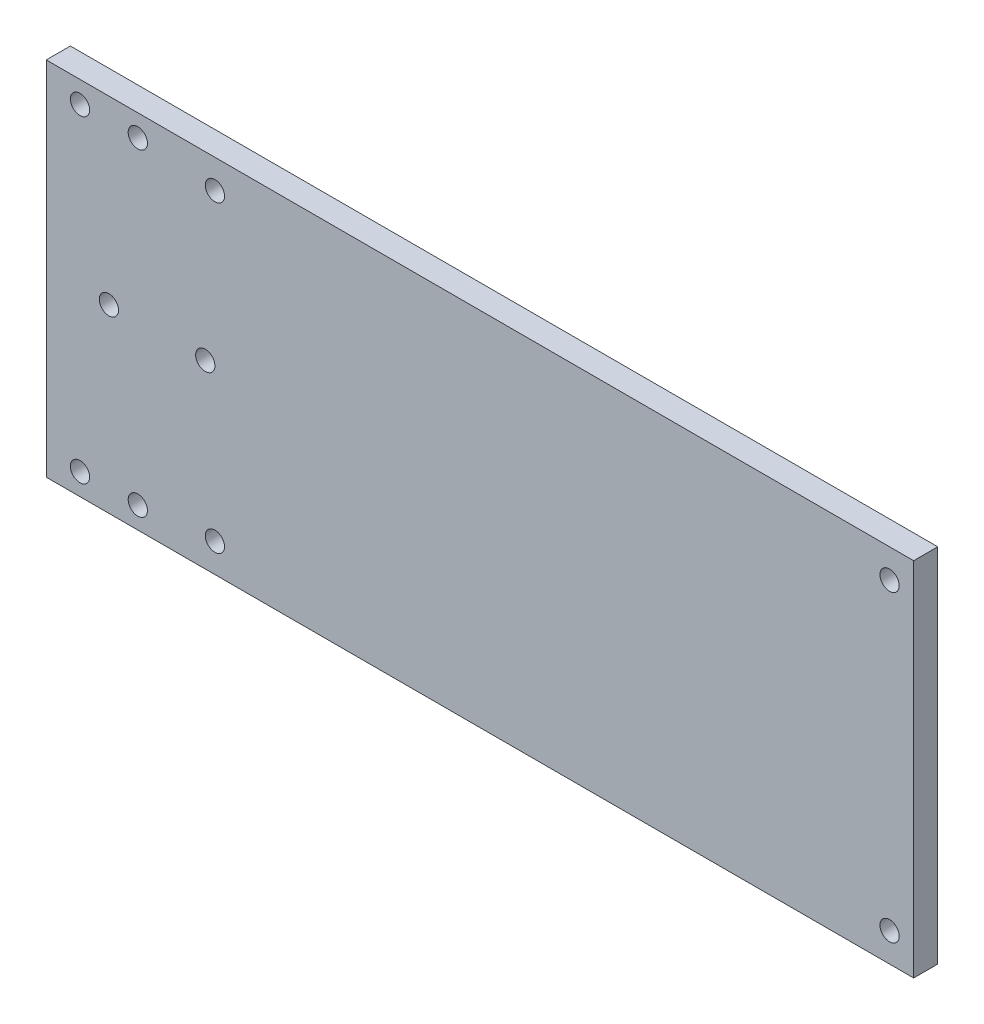
ISO-10303-21;
HEADER;
FILE_DESCRIPTION(('STEP AP214'),'2;1');
FILE_NAME('part.step','',(''),(''),'','','');
FILE_SCHEMA(('AUTOMOTIVE_DESIGN { 1 0 10303 214 1 1 1 1 }'));
ENDSEC;
DATA;
#1=APPLICATION_CONTEXT('core data for automotive mechanical design processes');
#2=APPLICATION_PROTOCOL_DEFINITION('international standard','automotive_design',2000,#1);
#3=PRODUCT_CONTEXT('',#1,'mechanical');
#4=PRODUCT('Part','Part','',(#3));
#5=PRODUCT_RELATED_PRODUCT_CATEGORY('part','',(#4));
#6=PRODUCT_DEFINITION_FORMATION('','',#4);
#7=PRODUCT_DEFINITION_CONTEXT('part definition',#1,'design');
#8=PRODUCT_DEFINITION('design','',#6,#7);
#9=PRODUCT_DEFINITION_SHAPE('','',#8);
#10=(LENGTH_UNIT() NAMED_UNIT(*) SI_UNIT(.MILLI.,.METRE.));
#11=(NAMED_UNIT(*) PLANE_ANGLE_UNIT() SI_UNIT($,.RADIAN.));
#12=(NAMED_UNIT(*) SI_UNIT($,.STERADIAN.) SOLID_ANGLE_UNIT());
#13=UNCERTAINTY_MEASURE_WITH_UNIT(LENGTH_MEASURE(1.E-05),#10,'distance_accuracy_value','');
#14=(GEOMETRIC_REPRESENTATION_CONTEXT(3) GLOBAL_UNCERTAINTY_ASSIGNED_CONTEXT((#13)) GLOBAL_UNIT_ASSIGNED_CONTEXT((#10,
#11,#12)) REPRESENTATION_CONTEXT('',''));
#15=CARTESIAN_POINT('',(0.,0.,0.));
#16=DIRECTION('',(0.,0.,1.));
#17=DIRECTION('',(1.,0.,0.));
#18=AXIS2_PLACEMENT_3D('',#15,#16,#17);
#19=CARTESIAN_POINT('',(0.,0.,5.));
#20=DIRECTION('',(0.,0.,-1.));
#21=DIRECTION('',(-1.,0.,0.));
#22=AXIS2_PLACEMENT_3D('',#19,#20,#21);
#23=PLANE('',#22);
#24=DIRECTION('',(0.,1.,0.));
#25=VECTOR('',#24,1.);
#26=CARTESIAN_POINT('',(90.,-37.5,5.));
#27=LINE('',#26,#25);
#28=CARTESIAN_POINT('',(90.,-37.5,5.));
#29=VERTEX_POINT('',#28);
#30=CARTESIAN_POINT('',(90.,37.5,5.));
#31=VERTEX_POINT('',#30);
#32=EDGE_CURVE('E85',#29,#31,#27,.T.);
#33=ORIENTED_EDGE('',*,*,#32,.T.);
#34=DIRECTION('',(-1.,0.,0.));
#35=VECTOR('',#34,1.);
#36=CARTESIAN_POINT('',(-90.,37.5,5.));
#37=LINE('',#36,#35);
#38=CARTESIAN_POINT('',(-90.,37.5,5.));
#39=VERTEX_POINT('',#38);
#40=EDGE_CURVE('E80',#31,#39,#37,.T.);
#41=ORIENTED_EDGE('',*,*,#40,.T.);
#42=DIRECTION('',(0.,-1.,0.));
#43=VECTOR('',#42,1.);
#44=CARTESIAN_POINT('',(-90.,-37.5,5.));
#45=LINE('',#44,#43);
#46=CARTESIAN_POINT('',(-90.,-37.5,5.));
#47=VERTEX_POINT('',#46);
#48=EDGE_CURVE('E83',#39,#47,#45,.T.);
#49=ORIENTED_EDGE('',*,*,#48,.T.);
#50=DIRECTION('',(1.,0.,0.));
#51=VECTOR('',#50,1.);
#52=CARTESIAN_POINT('',(-90.,-37.5,5.));
#53=LINE('',#52,#51);
#54=EDGE_CURVE('E50',#47,#29,#53,.T.);
#55=ORIENTED_EDGE('',*,*,#54,.T.);
#56=EDGE_LOOP('',(#33,#41,#49,#55));
#57=FACE_BOUND('',#56,.T.);
#58=CARTESIAN_POINT('',(-83.,33.,5.));
#59=DIRECTION('',(0.,0.,1.));
#60=DIRECTION('',(1.,0.,0.));
#61=AXIS2_PLACEMENT_3D('',#58,#59,#60);
#62=CIRCLE('',#61,2.);
#63=CARTESIAN_POINT('',(-81.,33.,5.));
#64=VERTEX_POINT('',#63);
#65=EDGE_CURVE('E100',#64,#64,#62,.T.);
#66=ORIENTED_EDGE('',*,*,#65,.F.);
#67=EDGE_LOOP('',(#66));
#68=FACE_BOUND('',#67,.T.);
#69=CARTESIAN_POINT('',(-76.9999999999976,0.,5.));
#70=DIRECTION('',(0.,0.,1.));
#71=DIRECTION('',(1.,0.,0.));
#72=AXIS2_PLACEMENT_3D('',#69,#70,#71);
#73=CIRCLE('',#72,2.);
#74=CARTESIAN_POINT('',(-74.9999999999976,0.,5.));
#75=VERTEX_POINT('',#74);
#76=EDGE_CURVE('E115',#75,#75,#73,.T.);
#77=ORIENTED_EDGE('',*,*,#76,.F.);
#78=EDGE_LOOP('',(#77));
#79=FACE_BOUND('',#78,.T.);
#80=CARTESIAN_POINT('',(-71.,33.,5.));
#81=DIRECTION('',(0.,0.,1.));
#82=DIRECTION('',(1.,0.,0.));
#83=AXIS2_PLACEMENT_3D('',#80,#81,#82);
#84=CIRCLE('',#83,2.);
#85=CARTESIAN_POINT('',(-69.,33.,5.));
#86=VERTEX_POINT('',#85);
#87=EDGE_CURVE('E121',#86,#86,#84,.T.);
#88=ORIENTED_EDGE('',*,*,#87,.F.);
#89=EDGE_LOOP('',(#88));
#90=FACE_BOUND('',#89,.T.);
#91=CARTESIAN_POINT('',(-70.9999999999956,-33.,5.));
#92=DIRECTION('',(0.,0.,1.));
#93=DIRECTION('',(1.,0.,0.));
#94=AXIS2_PLACEMENT_3D('',#91,#92,#93);
#95=CIRCLE('',#94,2.);
#96=CARTESIAN_POINT('',(-68.9999999999956,-33.,5.));
#97=VERTEX_POINT('',#96);
#98=EDGE_CURVE('E127',#97,#97,#95,.T.);
#99=ORIENTED_EDGE('',*,*,#98,.F.);
#100=EDGE_LOOP('',(#99));
#101=FACE_BOUND('',#100,.T.);
#102=CARTESIAN_POINT('',(-56.9999999999976,0.,5.));
#103=DIRECTION('',(0.,0.,1.));
#104=DIRECTION('',(1.,0.,0.));
#105=AXIS2_PLACEMENT_3D('',#102,#103,#104);
#106=CIRCLE('',#105,2.);
#107=CARTESIAN_POINT('',(-54.9999999999976,0.,5.));
#108=VERTEX_POINT('',#107);
#109=EDGE_CURVE('E133',#108,#108,#106,.T.);
#110=ORIENTED_EDGE('',*,*,#109,.F.);
#111=EDGE_LOOP('',(#110));
#112=FACE_BOUND('',#111,.T.);
#113=CARTESIAN_POINT('',(-82.9999999999965,-33.,5.));
#114=DIRECTION('',(0.,0.,1.));
#115=DIRECTION('',(1.,0.,0.));
#116=AXIS2_PLACEMENT_3D('',#113,#114,#115);
#117=CIRCLE('',#116,2.);
#118=CARTESIAN_POINT('',(-80.9999999999965,-33.,5.));
#119=VERTEX_POINT('',#118);
#120=EDGE_CURVE('E139',#119,#119,#117,.T.);
#121=ORIENTED_EDGE('',*,*,#120,.F.);
#122=EDGE_LOOP('',(#121));
#123=FACE_BOUND('',#122,.T.);
#124=CARTESIAN_POINT('',(-55.,31.5,5.));
#125=DIRECTION('',(0.,0.,1.));
#126=DIRECTION('',(1.,0.,0.));
#127=AXIS2_PLACEMENT_3D('',#124,#125,#126);
#128=CIRCLE('',#127,2.);
#129=CARTESIAN_POINT('',(-53.,31.5,5.));
#130=VERTEX_POINT('',#129);
#131=EDGE_CURVE('E145',#130,#130,#128,.T.);
#132=ORIENTED_EDGE('',*,*,#131,.F.);
#133=EDGE_LOOP('',(#132));
#134=FACE_BOUND('',#133,.T.);
#135=CARTESIAN_POINT('',(85.,31.5,5.));
#136=DIRECTION('',(0.,0.,1.));
#137=DIRECTION('',(1.,0.,0.));
#138=AXIS2_PLACEMENT_3D('',#135,#136,#137);
#139=CIRCLE('',#138,2.);
#140=CARTESIAN_POINT('',(87.,31.5,5.));
#141=VERTEX_POINT('',#140);
#142=EDGE_CURVE('E151',#141,#141,#139,.T.);
#143=ORIENTED_EDGE('',*,*,#142,.F.);
#144=EDGE_LOOP('',(#143));
#145=FACE_BOUND('',#144,.T.);
#146=CARTESIAN_POINT('',(85.,-31.5,5.));
#147=DIRECTION('',(0.,0.,1.));
#148=DIRECTION('',(-1.,0.,0.));
#149=AXIS2_PLACEMENT_3D('',#146,#147,#148);
#150=CIRCLE('',#149,2.);
#151=CARTESIAN_POINT('',(83.,-31.5,5.));
#152=VERTEX_POINT('',#151);
#153=EDGE_CURVE('E157',#152,#152,#150,.T.);
#154=ORIENTED_EDGE('',*,*,#153,.F.);
#155=EDGE_LOOP('',(#154));
#156=FACE_BOUND('',#155,.T.);
#157=CARTESIAN_POINT('',(-55.,-31.5,5.));
#158=DIRECTION('',(0.,0.,1.));
#159=DIRECTION('',(-1.,0.,0.));
#160=AXIS2_PLACEMENT_3D('',#157,#158,#159);
#161=CIRCLE('',#160,2.);
#162=CARTESIAN_POINT('',(-57.,-31.5,5.));
#163=VERTEX_POINT('',#162);
#164=EDGE_CURVE('E163',#163,#163,#161,.T.);
#165=ORIENTED_EDGE('',*,*,#164,.F.);
#166=EDGE_LOOP('',(#165));
#167=FACE_BOUND('',#166,.T.);
#168=ADVANCED_FACE('F33',(#57,#68,#79,#90,#101,#112,#123,#134,#145,#156,#167),#23,.F.);
#169=CARTESIAN_POINT('',(0.,0.,0.));
#170=DIRECTION('',(0.,0.,-1.));
#171=DIRECTION('',(-1.,0.,0.));
#172=AXIS2_PLACEMENT_3D('',#169,#170,#171);
#173=PLANE('',#172);
#174=CARTESIAN_POINT('',(85.,-31.5,0.));
#175=DIRECTION('',(0.,0.,1.));
#176=DIRECTION('',(-1.,0.,0.));
#177=AXIS2_PLACEMENT_3D('',#174,#175,#176);
#178=CIRCLE('',#177,2.);
#179=CARTESIAN_POINT('',(83.,-31.5,0.));
#180=VERTEX_POINT('',#179);
#181=EDGE_CURVE('E160',#180,#180,#178,.T.);
#182=ORIENTED_EDGE('',*,*,#181,.T.);
#183=EDGE_LOOP('',(#182));
#184=FACE_BOUND('',#183,.T.);
#185=CARTESIAN_POINT('',(-55.,31.5,0.));
#186=DIRECTION('',(0.,0.,1.));
#187=DIRECTION('',(1.,0.,0.));
#188=AXIS2_PLACEMENT_3D('',#185,#186,#187);
#189=CIRCLE('',#188,2.);
#190=CARTESIAN_POINT('',(-53.,31.5,0.));
#191=VERTEX_POINT('',#190);
#192=EDGE_CURVE('E148',#191,#191,#189,.T.);
#193=ORIENTED_EDGE('',*,*,#192,.T.);
#194=EDGE_LOOP('',(#193));
#195=FACE_BOUND('',#194,.T.);
#196=CARTESIAN_POINT('',(-56.9999999999976,0.,0.));
#197=DIRECTION('',(0.,0.,1.));
#198=DIRECTION('',(1.,0.,0.));
#199=AXIS2_PLACEMENT_3D('',#196,#197,#198);
#200=CIRCLE('',#199,2.);
#201=CARTESIAN_POINT('',(-54.9999999999976,0.,0.));
#202=VERTEX_POINT('',#201);
#203=EDGE_CURVE('E136',#202,#202,#200,.T.);
#204=ORIENTED_EDGE('',*,*,#203,.T.);
#205=EDGE_LOOP('',(#204));
#206=FACE_BOUND('',#205,.T.);
#207=CARTESIAN_POINT('',(-71.,33.,0.));
#208=DIRECTION('',(0.,0.,1.));
#209=DIRECTION('',(1.,0.,0.));
#210=AXIS2_PLACEMENT_3D('',#207,#208,#209);
#211=CIRCLE('',#210,2.);
#212=CARTESIAN_POINT('',(-69.,33.,0.));
#213=VERTEX_POINT('',#212);
#214=EDGE_CURVE('E124',#213,#213,#211,.T.);
#215=ORIENTED_EDGE('',*,*,#214,.T.);
#216=EDGE_LOOP('',(#215));
#217=FACE_BOUND('',#216,.T.);
#218=CARTESIAN_POINT('',(-83.,33.,0.));
#219=DIRECTION('',(0.,0.,1.));
#220=DIRECTION('',(1.,0.,0.));
#221=AXIS2_PLACEMENT_3D('',#218,#219,#220);
#222=CIRCLE('',#221,2.);
#223=CARTESIAN_POINT('',(-81.,33.,0.));
#224=VERTEX_POINT('',#223);
#225=EDGE_CURVE('E112',#224,#224,#222,.T.);
#226=ORIENTED_EDGE('',*,*,#225,.T.);
#227=EDGE_LOOP('',(#226));
#228=FACE_BOUND('',#227,.T.);
#229=DIRECTION('',(0.,1.,0.));
#230=VECTOR('',#229,1.);
#231=CARTESIAN_POINT('',(90.,-37.5,0.));
#232=LINE('',#231,#230);
#233=CARTESIAN_POINT('',(90.,-37.5,0.));
#234=VERTEX_POINT('',#233);
#235=CARTESIAN_POINT('',(90.,37.5,0.));
#236=VERTEX_POINT('',#235);
#237=EDGE_CURVE('E97',#234,#236,#232,.T.);
#238=ORIENTED_EDGE('',*,*,#237,.F.);
#239=DIRECTION('',(1.,0.,0.));
#240=VECTOR('',#239,1.);
#241=CARTESIAN_POINT('',(-90.,-37.5,0.));
#242=LINE('',#241,#240);
#243=CARTESIAN_POINT('',(-90.,-37.5,0.));
#244=VERTEX_POINT('',#243);
#245=EDGE_CURVE('E73',#244,#234,#242,.T.);
#246=ORIENTED_EDGE('',*,*,#245,.F.);
#247=DIRECTION('',(0.,-1.,0.));
#248=VECTOR('',#247,1.);
#249=CARTESIAN_POINT('',(-90.,-37.5,0.));
#250=LINE('',#249,#248);
#251=CARTESIAN_POINT('',(-90.,37.5,0.));
#252=VERTEX_POINT('',#251);
#253=EDGE_CURVE('E67',#252,#244,#250,.T.);
#254=ORIENTED_EDGE('',*,*,#253,.F.);
#255=DIRECTION('',(-1.,0.,0.));
#256=VECTOR('',#255,1.);
#257=CARTESIAN_POINT('',(-90.,37.5,0.));
#258=LINE('',#257,#256);
#259=EDGE_CURVE('E89',#236,#252,#258,.T.);
#260=ORIENTED_EDGE('',*,*,#259,.F.);
#261=EDGE_LOOP('',(#238,#246,#254,#260));
#262=FACE_BOUND('',#261,.T.);
#263=CARTESIAN_POINT('',(-76.9999999999976,0.,0.));
#264=DIRECTION('',(0.,0.,1.));
#265=DIRECTION('',(1.,0.,0.));
#266=AXIS2_PLACEMENT_3D('',#263,#264,#265);
#267=CIRCLE('',#266,2.);
#268=CARTESIAN_POINT('',(-74.9999999999976,0.,0.));
#269=VERTEX_POINT('',#268);
#270=EDGE_CURVE('E118',#269,#269,#267,.T.);
#271=ORIENTED_EDGE('',*,*,#270,.T.);
#272=EDGE_LOOP('',(#271));
#273=FACE_BOUND('',#272,.T.);
#274=CARTESIAN_POINT('',(-70.9999999999956,-33.,0.));
#275=DIRECTION('',(0.,0.,1.));
#276=DIRECTION('',(1.,0.,0.));
#277=AXIS2_PLACEMENT_3D('',#274,#275,#276);
#278=CIRCLE('',#277,2.);
#279=CARTESIAN_POINT('',(-68.9999999999956,-33.,0.));
#280=VERTEX_POINT('',#279);
#281=EDGE_CURVE('E130',#280,#280,#278,.T.);
#282=ORIENTED_EDGE('',*,*,#281,.T.);
#283=EDGE_LOOP('',(#282));
#284=FACE_BOUND('',#283,.T.);
#285=CARTESIAN_POINT('',(-82.9999999999965,-33.,0.));
#286=DIRECTION('',(0.,0.,1.));
#287=DIRECTION('',(1.,0.,0.));
#288=AXIS2_PLACEMENT_3D('',#285,#286,#287);
#289=CIRCLE('',#288,2.);
#290=CARTESIAN_POINT('',(-80.9999999999965,-33.,0.));
#291=VERTEX_POINT('',#290);
#292=EDGE_CURVE('E142',#291,#291,#289,.T.);
#293=ORIENTED_EDGE('',*,*,#292,.T.);
#294=EDGE_LOOP('',(#293));
#295=FACE_BOUND('',#294,.T.);
#296=CARTESIAN_POINT('',(85.,31.5,0.));
#297=DIRECTION('',(0.,0.,1.));
#298=DIRECTION('',(1.,0.,0.));
#299=AXIS2_PLACEMENT_3D('',#296,#297,#298);
#300=CIRCLE('',#299,2.);
#301=CARTESIAN_POINT('',(87.,31.5,0.));
#302=VERTEX_POINT('',#301);
#303=EDGE_CURVE('E154',#302,#302,#300,.T.);
#304=ORIENTED_EDGE('',*,*,#303,.T.);
#305=EDGE_LOOP('',(#304));
#306=FACE_BOUND('',#305,.T.);
#307=CARTESIAN_POINT('',(-55.,-31.5,0.));
#308=DIRECTION('',(0.,0.,1.));
#309=DIRECTION('',(-1.,0.,0.));
#310=AXIS2_PLACEMENT_3D('',#307,#308,#309);
#311=CIRCLE('',#310,2.);
#312=CARTESIAN_POINT('',(-57.,-31.5,0.));
#313=VERTEX_POINT('',#312);
#314=EDGE_CURVE('E166',#313,#313,#311,.T.);
#315=ORIENTED_EDGE('',*,*,#314,.T.);
#316=EDGE_LOOP('',(#315));
#317=FACE_BOUND('',#316,.T.);
#318=ADVANCED_FACE('F108',(#184,#195,#206,#217,#228,#262,#273,#284,#295,#306,#317),#173,.T.);
#319=CARTESIAN_POINT('',(90.,-37.5,5.));
#320=DIRECTION('',(-1.,0.,0.));
#321=DIRECTION('',(0.,0.,1.));
#322=AXIS2_PLACEMENT_3D('',#319,#320,#321);
#323=PLANE('',#322);
#324=ORIENTED_EDGE('',*,*,#237,.T.);
#325=DIRECTION('',(0.,0.,-1.));
#326=VECTOR('',#325,1.);
#327=CARTESIAN_POINT('',(90.,37.5,5.));
#328=LINE('',#327,#326);
#329=EDGE_CURVE('E11',#31,#236,#328,.T.);
#330=ORIENTED_EDGE('',*,*,#329,.F.);
#331=ORIENTED_EDGE('',*,*,#32,.F.);
#332=DIRECTION('',(0.,0.,-1.));
#333=VECTOR('',#332,1.);
#334=CARTESIAN_POINT('',(90.,-37.5,5.));
#335=LINE('',#334,#333);
#336=EDGE_CURVE('E93',#29,#234,#335,.T.);
#337=ORIENTED_EDGE('',*,*,#336,.T.);
#338=EDGE_LOOP('',(#324,#330,#331,#337));
#339=FACE_BOUND('',#338,.T.);
#340=ADVANCED_FACE('F35',(#339),#323,.F.);
#341=CARTESIAN_POINT('',(-90.,37.5,5.));
#342=DIRECTION('',(0.,-1.,0.));
#343=DIRECTION('',(0.,0.,-1.));
#344=AXIS2_PLACEMENT_3D('',#341,#342,#343);
#345=PLANE('',#344);
#346=ORIENTED_EDGE('',*,*,#259,.T.);
#347=DIRECTION('',(0.,0.,-1.));
#348=VECTOR('',#347,1.);
#349=CARTESIAN_POINT('',(-90.,37.5,5.));
#350=LINE('',#349,#348);
#351=EDGE_CURVE('E42',#39,#252,#350,.T.);
#352=ORIENTED_EDGE('',*,*,#351,.F.);
#353=ORIENTED_EDGE('',*,*,#40,.F.);
#354=ORIENTED_EDGE('',*,*,#329,.T.);
#355=EDGE_LOOP('',(#346,#352,#353,#354));
#356=FACE_BOUND('',#355,.T.);
#357=ADVANCED_FACE('F88',(#356),#345,.F.);
#358=CARTESIAN_POINT('',(-90.,-37.5,5.));
#359=DIRECTION('',(1.,0.,0.));
#360=DIRECTION('',(0.,0.,-1.));
#361=AXIS2_PLACEMENT_3D('',#358,#359,#360);
#362=PLANE('',#361);
#363=ORIENTED_EDGE('',*,*,#253,.T.);
#364=DIRECTION('',(0.,0.,-1.));
#365=VECTOR('',#364,1.);
#366=CARTESIAN_POINT('',(-90.,-37.5,5.));
#367=LINE('',#366,#365);
#368=EDGE_CURVE('E90',#47,#244,#367,.T.);
#369=ORIENTED_EDGE('',*,*,#368,.F.);
#370=ORIENTED_EDGE('',*,*,#48,.F.);
#371=ORIENTED_EDGE('',*,*,#351,.T.);
#372=EDGE_LOOP('',(#363,#369,#370,#371));
#373=FACE_BOUND('',#372,.T.);
#374=ADVANCED_FACE('F91',(#373),#362,.F.);
#375=CARTESIAN_POINT('',(-90.,-37.5,5.));
#376=DIRECTION('',(0.,1.,0.));
#377=DIRECTION('',(0.,0.,1.));
#378=AXIS2_PLACEMENT_3D('',#375,#376,#377);
#379=PLANE('',#378);
#380=ORIENTED_EDGE('',*,*,#245,.T.);
#381=ORIENTED_EDGE('',*,*,#336,.F.);
#382=ORIENTED_EDGE('',*,*,#54,.F.);
#383=ORIENTED_EDGE('',*,*,#368,.T.);
#384=EDGE_LOOP('',(#380,#381,#382,#383));
#385=FACE_BOUND('',#384,.T.);
#386=ADVANCED_FACE('F105',(#385),#379,.F.);
#387=CARTESIAN_POINT('',(-83.,33.,5.));
#388=DIRECTION('',(0.,0.,-1.));
#389=DIRECTION('',(-1.,0.,0.));
#390=AXIS2_PLACEMENT_3D('',#387,#388,#389);
#391=CYLINDRICAL_SURFACE('',#390,2.);
#392=ORIENTED_EDGE('',*,*,#65,.T.);
#393=EDGE_LOOP('',(#392));
#394=FACE_BOUND('',#393,.T.);
#395=ORIENTED_EDGE('',*,*,#225,.F.);
#396=EDGE_LOOP('',(#395));
#397=FACE_BOUND('',#396,.T.);
#398=ADVANCED_FACE('F183',(#394,#397),#391,.F.);
#399=CARTESIAN_POINT('',(-76.9999999999976,0.,5.));
#400=DIRECTION('',(0.,0.,-1.));
#401=DIRECTION('',(-1.,0.,0.));
#402=AXIS2_PLACEMENT_3D('',#399,#400,#401);
#403=CYLINDRICAL_SURFACE('',#402,2.);
#404=ORIENTED_EDGE('',*,*,#76,.T.);
#405=EDGE_LOOP('',(#404));
#406=FACE_BOUND('',#405,.T.);
#407=ORIENTED_EDGE('',*,*,#270,.F.);
#408=EDGE_LOOP('',(#407));
#409=FACE_BOUND('',#408,.T.);
#410=ADVANCED_FACE('F229',(#406,#409),#403,.F.);
#411=CARTESIAN_POINT('',(-71.,33.,5.));
#412=DIRECTION('',(0.,0.,-1.));
#413=DIRECTION('',(-1.,0.,0.));
#414=AXIS2_PLACEMENT_3D('',#411,#412,#413);
#415=CYLINDRICAL_SURFACE('',#414,2.);
#416=ORIENTED_EDGE('',*,*,#87,.T.);
#417=EDGE_LOOP('',(#416));
#418=FACE_BOUND('',#417,.T.);
#419=ORIENTED_EDGE('',*,*,#214,.F.);
#420=EDGE_LOOP('',(#419));
#421=FACE_BOUND('',#420,.T.);
#422=ADVANCED_FACE('F237',(#418,#421),#415,.F.);
#423=CARTESIAN_POINT('',(-70.9999999999956,-33.,5.));
#424=DIRECTION('',(0.,0.,-1.));
#425=DIRECTION('',(-1.,0.,0.));
#426=AXIS2_PLACEMENT_3D('',#423,#424,#425);
#427=CYLINDRICAL_SURFACE('',#426,2.);
#428=ORIENTED_EDGE('',*,*,#98,.T.);
#429=EDGE_LOOP('',(#428));
#430=FACE_BOUND('',#429,.T.);
#431=ORIENTED_EDGE('',*,*,#281,.F.);
#432=EDGE_LOOP('',(#431));
#433=FACE_BOUND('',#432,.T.);
#434=ADVANCED_FACE('F245',(#430,#433),#427,.F.);
#435=CARTESIAN_POINT('',(-56.9999999999976,0.,5.));
#436=DIRECTION('',(0.,0.,-1.));
#437=DIRECTION('',(-1.,0.,0.));
#438=AXIS2_PLACEMENT_3D('',#435,#436,#437);
#439=CYLINDRICAL_SURFACE('',#438,2.);
#440=ORIENTED_EDGE('',*,*,#109,.T.);
#441=EDGE_LOOP('',(#440));
#442=FACE_BOUND('',#441,.T.);
#443=ORIENTED_EDGE('',*,*,#203,.F.);
#444=EDGE_LOOP('',(#443));
#445=FACE_BOUND('',#444,.T.);
#446=ADVANCED_FACE('F254',(#442,#445),#439,.F.);
#447=CARTESIAN_POINT('',(-82.9999999999965,-33.,5.));
#448=DIRECTION('',(0.,0.,-1.));
#449=DIRECTION('',(-1.,0.,0.));
#450=AXIS2_PLACEMENT_3D('',#447,#448,#449);
#451=CYLINDRICAL_SURFACE('',#450,2.);
#452=ORIENTED_EDGE('',*,*,#120,.T.);
#453=EDGE_LOOP('',(#452));
#454=FACE_BOUND('',#453,.T.);
#455=ORIENTED_EDGE('',*,*,#292,.F.);
#456=EDGE_LOOP('',(#455));
#457=FACE_BOUND('',#456,.T.);
#458=ADVANCED_FACE('F263',(#454,#457),#451,.F.);
#459=CARTESIAN_POINT('',(-55.,31.5,5.));
#460=DIRECTION('',(0.,0.,-1.));
#461=DIRECTION('',(-1.,0.,0.));
#462=AXIS2_PLACEMENT_3D('',#459,#460,#461);
#463=CYLINDRICAL_SURFACE('',#462,2.);
#464=ORIENTED_EDGE('',*,*,#131,.T.);
#465=EDGE_LOOP('',(#464));
#466=FACE_BOUND('',#465,.T.);
#467=ORIENTED_EDGE('',*,*,#192,.F.);
#468=EDGE_LOOP('',(#467));
#469=FACE_BOUND('',#468,.T.);
#470=ADVANCED_FACE('F272',(#466,#469),#463,.F.);
#471=CARTESIAN_POINT('',(85.,31.5,5.));
#472=DIRECTION('',(0.,0.,-1.));
#473=DIRECTION('',(-1.,0.,0.));
#474=AXIS2_PLACEMENT_3D('',#471,#472,#473);
#475=CYLINDRICAL_SURFACE('',#474,2.);
#476=ORIENTED_EDGE('',*,*,#142,.T.);
#477=EDGE_LOOP('',(#476));
#478=FACE_BOUND('',#477,.T.);
#479=ORIENTED_EDGE('',*,*,#303,.F.);
#480=EDGE_LOOP('',(#479));
#481=FACE_BOUND('',#480,.T.);
#482=ADVANCED_FACE('F281',(#478,#481),#475,.F.);
#483=CARTESIAN_POINT('',(85.,-31.5,5.));
#484=DIRECTION('',(0.,0.,-1.));
#485=DIRECTION('',(-1.,0.,0.));
#486=AXIS2_PLACEMENT_3D('',#483,#484,#485);
#487=CYLINDRICAL_SURFACE('',#486,2.);
#488=ORIENTED_EDGE('',*,*,#153,.T.);
#489=EDGE_LOOP('',(#488));
#490=FACE_BOUND('',#489,.T.);
#491=ORIENTED_EDGE('',*,*,#181,.F.);
#492=EDGE_LOOP('',(#491));
#493=FACE_BOUND('',#492,.T.);
#494=ADVANCED_FACE('F290',(#490,#493),#487,.F.);
#495=CARTESIAN_POINT('',(-55.,-31.5,5.));
#496=DIRECTION('',(0.,0.,-1.));
#497=DIRECTION('',(-1.,0.,0.));
#498=AXIS2_PLACEMENT_3D('',#495,#496,#497);
#499=CYLINDRICAL_SURFACE('',#498,2.);
#500=ORIENTED_EDGE('',*,*,#164,.T.);
#501=EDGE_LOOP('',(#500));
#502=FACE_BOUND('',#501,.T.);
#503=ORIENTED_EDGE('',*,*,#314,.F.);
#504=EDGE_LOOP('',(#503));
#505=FACE_BOUND('',#504,.T.);
#506=ADVANCED_FACE('F172',(#502,#505),#499,.F.);
#507=CLOSED_SHELL('',(#168,#318,#340,#357,#374,#386,#398,#410,#422,#434,#446,#458,#470,#482,
#494,#506));
#508=MANIFOLD_SOLID_BREP('B2',#507);
#509=ADVANCED_BREP_SHAPE_REPRESENTATION('',(#18,#508),#14);
#510=SHAPE_DEFINITION_REPRESENTATION(#9,#509);
ENDSEC;
END-ISO-10303-21;
